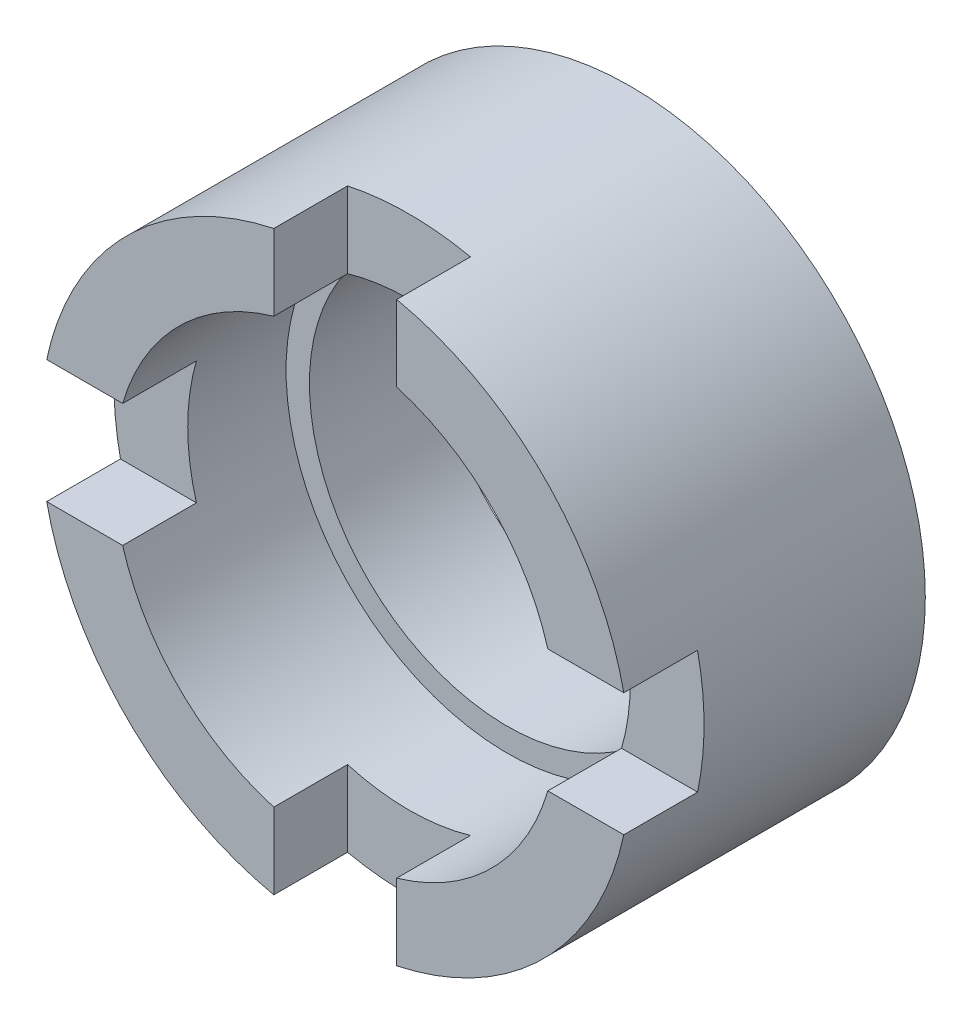
ISO-10303-21;
HEADER;
FILE_DESCRIPTION(('STEP AP214'),'2;1');
FILE_NAME('part.step','',(''),(''),'','','');
FILE_SCHEMA(('AUTOMOTIVE_DESIGN { 1 0 10303 214 1 1 1 1 }'));
ENDSEC;
DATA;
#1=APPLICATION_CONTEXT('core data for automotive mechanical design processes');
#2=APPLICATION_PROTOCOL_DEFINITION('international standard','automotive_design',2000,#1);
#3=PRODUCT_CONTEXT('',#1,'mechanical');
#4=PRODUCT('Part','Part','',(#3));
#5=PRODUCT_RELATED_PRODUCT_CATEGORY('part','',(#4));
#6=PRODUCT_DEFINITION_FORMATION('','',#4);
#7=PRODUCT_DEFINITION_CONTEXT('part definition',#1,'design');
#8=PRODUCT_DEFINITION('design','',#6,#7);
#9=PRODUCT_DEFINITION_SHAPE('','',#8);
#10=(LENGTH_UNIT() NAMED_UNIT(*) SI_UNIT(.MILLI.,.METRE.));
#11=(NAMED_UNIT(*) PLANE_ANGLE_UNIT() SI_UNIT($,.RADIAN.));
#12=(NAMED_UNIT(*) SI_UNIT($,.STERADIAN.) SOLID_ANGLE_UNIT());
#13=UNCERTAINTY_MEASURE_WITH_UNIT(LENGTH_MEASURE(1.E-05),#10,'distance_accuracy_value','');
#14=(GEOMETRIC_REPRESENTATION_CONTEXT(3) GLOBAL_UNCERTAINTY_ASSIGNED_CONTEXT((#13)) GLOBAL_UNIT_ASSIGNED_CONTEXT((#10,
#11,#12)) REPRESENTATION_CONTEXT('',''));
#15=CARTESIAN_POINT('',(0.,0.,0.));
#16=DIRECTION('',(0.,0.,1.));
#17=DIRECTION('',(1.,0.,0.));
#18=AXIS2_PLACEMENT_3D('',#15,#16,#17);
#19=CARTESIAN_POINT('',(0.,0.,12.));
#20=DIRECTION('',(0.,0.,-1.));
#21=DIRECTION('',(-1.,0.,0.));
#22=AXIS2_PLACEMENT_3D('',#19,#20,#21);
#23=CYLINDRICAL_SURFACE('',#22,8.05);
#24=CARTESIAN_POINT('',(0.,0.,0.));
#25=DIRECTION('',(0.,0.,1.));
#26=DIRECTION('',(1.,0.,0.));
#27=AXIS2_PLACEMENT_3D('',#24,#25,#26);
#28=CIRCLE('',#27,8.05);
#29=CARTESIAN_POINT('',(8.05,0.,0.));
#30=VERTEX_POINT('',#29);
#31=EDGE_CURVE('E224',#30,#30,#28,.T.);
#32=ORIENTED_EDGE('',*,*,#31,.F.);
#33=EDGE_LOOP('',(#32));
#34=FACE_BOUND('',#33,.T.);
#35=CARTESIAN_POINT('',(0.,0.,5.));
#36=DIRECTION('',(0.,0.,1.));
#37=DIRECTION('',(1.,0.,0.));
#38=AXIS2_PLACEMENT_3D('',#35,#36,#37);
#39=CIRCLE('',#38,8.05);
#40=CARTESIAN_POINT('',(8.05,0.,5.));
#41=VERTEX_POINT('',#40);
#42=EDGE_CURVE('E49',#41,#41,#39,.T.);
#43=ORIENTED_EDGE('',*,*,#42,.T.);
#44=EDGE_LOOP('',(#43));
#45=FACE_BOUND('',#44,.T.);
#46=ADVANCED_FACE('F45',(#34,#45),#23,.F.);
#47=CARTESIAN_POINT('',(0.,0.,12.));
#48=DIRECTION('',(0.,0.,1.));
#49=DIRECTION('',(1.,0.,0.));
#50=AXIS2_PLACEMENT_3D('',#47,#48,#49);
#51=PLANE('',#50);
#52=CARTESIAN_POINT('',(0.,0.,12.));
#53=DIRECTION('',(0.,0.,1.));
#54=DIRECTION('',(1.,0.,0.));
#55=AXIS2_PLACEMENT_3D('',#52,#53,#54);
#56=CIRCLE('',#55,9.);
#57=CARTESIAN_POINT('',(-2.5,8.64580823289529,12.));
#58=VERTEX_POINT('',#57);
#59=CARTESIAN_POINT('',(-8.64580823289529,2.5,12.));
#60=VERTEX_POINT('',#59);
#61=EDGE_CURVE('E178',#58,#60,#56,.T.);
#62=ORIENTED_EDGE('',*,*,#61,.F.);
#63=DIRECTION('',(0.,-1.,0.));
#64=VECTOR('',#63,1.);
#65=CARTESIAN_POINT('',(-2.5,16.5,12.));
#66=LINE('',#65,#64);
#67=CARTESIAN_POINT('',(-2.5,11.7366945943055,12.));
#68=VERTEX_POINT('',#67);
#69=EDGE_CURVE('E186',#68,#58,#66,.T.);
#70=ORIENTED_EDGE('',*,*,#69,.F.);
#71=CARTESIAN_POINT('',(0.,0.,12.));
#72=DIRECTION('',(0.,0.,1.));
#73=DIRECTION('',(1.,0.,0.));
#74=AXIS2_PLACEMENT_3D('',#71,#72,#73);
#75=CIRCLE('',#74,12.);
#76=CARTESIAN_POINT('',(-11.7366945943055,2.5,12.));
#77=VERTEX_POINT('',#76);
#78=EDGE_CURVE('E229',#68,#77,#75,.T.);
#79=ORIENTED_EDGE('',*,*,#78,.T.);
#80=DIRECTION('',(-1.,0.,0.));
#81=VECTOR('',#80,1.);
#82=CARTESIAN_POINT('',(-16.5,2.5,12.));
#83=LINE('',#82,#81);
#84=EDGE_CURVE('E194',#60,#77,#83,.T.);
#85=ORIENTED_EDGE('',*,*,#84,.F.);
#86=EDGE_LOOP('',(#62,#70,#79,#85));
#87=FACE_BOUND('',#86,.T.);
#88=ADVANCED_FACE('F251',(#87),#51,.T.);
#89=CARTESIAN_POINT('',(8.64580823289529,2.5,12.));
#90=VERTEX_POINT('',#89);
#91=CARTESIAN_POINT('',(2.5,8.64580823289529,12.));
#92=VERTEX_POINT('',#91);
#93=EDGE_CURVE('E160',#90,#92,#56,.T.);
#94=ORIENTED_EDGE('',*,*,#93,.F.);
#95=DIRECTION('',(-1.,0.,0.));
#96=VECTOR('',#95,1.);
#97=CARTESIAN_POINT('',(2.5,2.5,12.));
#98=LINE('',#97,#96);
#99=CARTESIAN_POINT('',(11.7366945943055,2.5,12.));
#100=VERTEX_POINT('',#99);
#101=EDGE_CURVE('E174',#100,#90,#98,.T.);
#102=ORIENTED_EDGE('',*,*,#101,.F.);
#103=CARTESIAN_POINT('',(2.5,11.7366945943055,12.));
#104=VERTEX_POINT('',#103);
#105=EDGE_CURVE('E54',#100,#104,#75,.T.);
#106=ORIENTED_EDGE('',*,*,#105,.T.);
#107=DIRECTION('',(0.,1.,0.));
#108=VECTOR('',#107,1.);
#109=CARTESIAN_POINT('',(2.5,16.5,12.));
#110=LINE('',#109,#108);
#111=EDGE_CURVE('E176',#92,#104,#110,.T.);
#112=ORIENTED_EDGE('',*,*,#111,.F.);
#113=EDGE_LOOP('',(#94,#102,#106,#112));
#114=FACE_BOUND('',#113,.T.);
#115=ADVANCED_FACE('F172',(#114),#51,.T.);
#116=CARTESIAN_POINT('',(2.5,-8.64580823289529,12.));
#117=VERTEX_POINT('',#116);
#118=CARTESIAN_POINT('',(8.64580823289529,-2.5,12.));
#119=VERTEX_POINT('',#118);
#120=EDGE_CURVE('E180',#117,#119,#56,.T.);
#121=ORIENTED_EDGE('',*,*,#120,.F.);
#122=DIRECTION('',(0.,1.,0.));
#123=VECTOR('',#122,1.);
#124=CARTESIAN_POINT('',(2.5,-2.5,12.));
#125=LINE('',#124,#123);
#126=CARTESIAN_POINT('',(2.50000000000001,-11.7366945943055,12.));
#127=VERTEX_POINT('',#126);
#128=EDGE_CURVE('E188',#127,#117,#125,.T.);
#129=ORIENTED_EDGE('',*,*,#128,.F.);
#130=CARTESIAN_POINT('',(11.7366945943055,-2.5,12.));
#131=VERTEX_POINT('',#130);
#132=EDGE_CURVE('E230',#127,#131,#75,.T.);
#133=ORIENTED_EDGE('',*,*,#132,.T.);
#134=DIRECTION('',(1.,0.,0.));
#135=VECTOR('',#134,1.);
#136=CARTESIAN_POINT('',(2.5,-2.5,12.));
#137=LINE('',#136,#135);
#138=EDGE_CURVE('E184',#119,#131,#137,.T.);
#139=ORIENTED_EDGE('',*,*,#138,.F.);
#140=EDGE_LOOP('',(#121,#129,#133,#139));
#141=FACE_BOUND('',#140,.T.);
#142=ADVANCED_FACE('F308',(#141),#51,.T.);
#143=CARTESIAN_POINT('',(-8.64580823289529,-2.5,12.));
#144=VERTEX_POINT('',#143);
#145=CARTESIAN_POINT('',(-2.5,-8.64580823289529,12.));
#146=VERTEX_POINT('',#145);
#147=EDGE_CURVE('E388',#144,#146,#56,.T.);
#148=ORIENTED_EDGE('',*,*,#147,.F.);
#149=DIRECTION('',(1.,0.,0.));
#150=VECTOR('',#149,1.);
#151=CARTESIAN_POINT('',(-16.5,-2.5,12.));
#152=LINE('',#151,#150);
#153=CARTESIAN_POINT('',(-11.7366945943055,-2.5,12.));
#154=VERTEX_POINT('',#153);
#155=EDGE_CURVE('E299',#154,#144,#152,.T.);
#156=ORIENTED_EDGE('',*,*,#155,.F.);
#157=CARTESIAN_POINT('',(-2.5,-11.7366945943055,12.));
#158=VERTEX_POINT('',#157);
#159=EDGE_CURVE('E235',#154,#158,#75,.T.);
#160=ORIENTED_EDGE('',*,*,#159,.T.);
#161=DIRECTION('',(0.,-1.,0.));
#162=VECTOR('',#161,1.);
#163=CARTESIAN_POINT('',(-2.5,-2.5,12.));
#164=LINE('',#163,#162);
#165=EDGE_CURVE('E302',#146,#158,#164,.T.);
#166=ORIENTED_EDGE('',*,*,#165,.F.);
#167=EDGE_LOOP('',(#148,#156,#160,#166));
#168=FACE_BOUND('',#167,.T.);
#169=ADVANCED_FACE('F347',(#168),#51,.T.);
#170=CARTESIAN_POINT('',(0.,0.,0.));
#171=DIRECTION('',(0.,0.,1.));
#172=DIRECTION('',(1.,0.,0.));
#173=AXIS2_PLACEMENT_3D('',#170,#171,#172);
#174=PLANE('',#173);
#175=CARTESIAN_POINT('',(0.,0.,0.));
#176=DIRECTION('',(0.,0.,1.));
#177=DIRECTION('',(1.,0.,0.));
#178=AXIS2_PLACEMENT_3D('',#175,#176,#177);
#179=CIRCLE('',#178,12.);
#180=CARTESIAN_POINT('',(12.,0.,0.));
#181=VERTEX_POINT('',#180);
#182=EDGE_CURVE('E227',#181,#181,#179,.T.);
#183=ORIENTED_EDGE('',*,*,#182,.F.);
#184=EDGE_LOOP('',(#183));
#185=FACE_BOUND('',#184,.T.);
#186=ORIENTED_EDGE('',*,*,#31,.T.);
#187=EDGE_LOOP('',(#186));
#188=FACE_BOUND('',#187,.T.);
#189=ADVANCED_FACE('F354',(#185,#188),#174,.F.);
#190=CARTESIAN_POINT('',(0.,0.,12.));
#191=DIRECTION('',(0.,0.,-1.));
#192=DIRECTION('',(-1.,0.,0.));
#193=AXIS2_PLACEMENT_3D('',#190,#191,#192);
#194=CYLINDRICAL_SURFACE('',#193,12.);
#195=ORIENTED_EDGE('',*,*,#78,.F.);
#196=DIRECTION('',(0.,0.,-1.));
#197=VECTOR('',#196,1.);
#198=CARTESIAN_POINT('',(-2.5,11.7366945943055,12.));
#199=LINE('',#198,#197);
#200=CARTESIAN_POINT('',(-2.5,11.7366945943055,9.));
#201=VERTEX_POINT('',#200);
#202=EDGE_CURVE('E218',#68,#201,#199,.T.);
#203=ORIENTED_EDGE('',*,*,#202,.T.);
#204=CARTESIAN_POINT('',(0.,0.,9.));
#205=DIRECTION('',(0.,0.,1.));
#206=DIRECTION('',(1.,0.,0.));
#207=AXIS2_PLACEMENT_3D('',#204,#205,#206);
#208=CIRCLE('',#207,12.);
#209=CARTESIAN_POINT('',(2.5,11.7366945943055,9.));
#210=VERTEX_POINT('',#209);
#211=EDGE_CURVE('E201',#210,#201,#208,.T.);
#212=ORIENTED_EDGE('',*,*,#211,.F.);
#213=DIRECTION('',(0.,0.,-1.));
#214=VECTOR('',#213,1.);
#215=CARTESIAN_POINT('',(2.5,11.7366945943055,12.));
#216=LINE('',#215,#214);
#217=EDGE_CURVE('E215',#210,#104,#216,.F.);
#218=ORIENTED_EDGE('',*,*,#217,.T.);
#219=ORIENTED_EDGE('',*,*,#105,.F.);
#220=DIRECTION('',(0.,0.,-1.));
#221=VECTOR('',#220,1.);
#222=CARTESIAN_POINT('',(11.7366945943055,2.5,12.));
#223=LINE('',#222,#221);
#224=CARTESIAN_POINT('',(11.7366945943055,2.5,9.));
#225=VERTEX_POINT('',#224);
#226=EDGE_CURVE('E183',#100,#225,#223,.T.);
#227=ORIENTED_EDGE('',*,*,#226,.T.);
#228=CARTESIAN_POINT('',(11.7366945943055,-2.5,9.));
#229=VERTEX_POINT('',#228);
#230=EDGE_CURVE('E197',#229,#225,#208,.T.);
#231=ORIENTED_EDGE('',*,*,#230,.F.);
#232=DIRECTION('',(0.,0.,-1.));
#233=VECTOR('',#232,1.);
#234=CARTESIAN_POINT('',(11.7366945943055,-2.5,12.));
#235=LINE('',#234,#233);
#236=EDGE_CURVE('E211',#229,#131,#235,.F.);
#237=ORIENTED_EDGE('',*,*,#236,.T.);
#238=ORIENTED_EDGE('',*,*,#132,.F.);
#239=DIRECTION('',(0.,0.,-1.));
#240=VECTOR('',#239,1.);
#241=CARTESIAN_POINT('',(2.50000000000001,-11.7366945943055,12.));
#242=LINE('',#241,#240);
#243=CARTESIAN_POINT('',(2.50000000000001,-11.7366945943055,9.));
#244=VERTEX_POINT('',#243);
#245=EDGE_CURVE('E208',#127,#244,#242,.T.);
#246=ORIENTED_EDGE('',*,*,#245,.T.);
#247=CARTESIAN_POINT('',(-2.5,-11.7366945943055,9.));
#248=VERTEX_POINT('',#247);
#249=EDGE_CURVE('E199',#248,#244,#208,.T.);
#250=ORIENTED_EDGE('',*,*,#249,.F.);
#251=DIRECTION('',(0.,0.,-1.));
#252=VECTOR('',#251,1.);
#253=CARTESIAN_POINT('',(-2.5,-11.7366945943055,12.));
#254=LINE('',#253,#252);
#255=EDGE_CURVE('E205',#248,#158,#254,.F.);
#256=ORIENTED_EDGE('',*,*,#255,.T.);
#257=ORIENTED_EDGE('',*,*,#159,.F.);
#258=DIRECTION('',(0.,0.,-1.));
#259=VECTOR('',#258,1.);
#260=CARTESIAN_POINT('',(-11.7366945943055,-2.5,12.));
#261=LINE('',#260,#259);
#262=CARTESIAN_POINT('',(-11.7366945943055,-2.5,9.));
#263=VERTEX_POINT('',#262);
#264=EDGE_CURVE('E202',#154,#263,#261,.T.);
#265=ORIENTED_EDGE('',*,*,#264,.T.);
#266=CARTESIAN_POINT('',(-11.7366945943055,2.5,9.));
#267=VERTEX_POINT('',#266);
#268=EDGE_CURVE('E68',#267,#263,#208,.T.);
#269=ORIENTED_EDGE('',*,*,#268,.F.);
#270=DIRECTION('',(0.,0.,-1.));
#271=VECTOR('',#270,1.);
#272=CARTESIAN_POINT('',(-11.7366945943055,2.5,12.));
#273=LINE('',#272,#271);
#274=EDGE_CURVE('E221',#267,#77,#273,.F.);
#275=ORIENTED_EDGE('',*,*,#274,.T.);
#276=EDGE_LOOP('',(#195,#203,#212,#218,#219,#227,#231,#237,#238,#246,#250,#256,#257,#265,#269,#275));
#277=FACE_BOUND('',#276,.T.);
#278=ORIENTED_EDGE('',*,*,#182,.T.);
#279=EDGE_LOOP('',(#278));
#280=FACE_BOUND('',#279,.T.);
#281=ADVANCED_FACE('F47',(#277,#280),#194,.T.);
#282=CARTESIAN_POINT('',(0.,0.,9.));
#283=DIRECTION('',(0.,0.,1.));
#284=DIRECTION('',(1.,0.,0.));
#285=AXIS2_PLACEMENT_3D('',#282,#283,#284);
#286=PLANE('',#285);
#287=CARTESIAN_POINT('',(0.,0.,9.));
#288=DIRECTION('',(0.,0.,1.));
#289=DIRECTION('',(1.,0.,0.));
#290=AXIS2_PLACEMENT_3D('',#287,#288,#289);
#291=CIRCLE('',#290,9.);
#292=CARTESIAN_POINT('',(8.64580823289529,-2.5,9.));
#293=VERTEX_POINT('',#292);
#294=CARTESIAN_POINT('',(8.64580823289529,2.5,9.));
#295=VERTEX_POINT('',#294);
#296=EDGE_CURVE('E162',#293,#295,#291,.T.);
#297=ORIENTED_EDGE('',*,*,#296,.F.);
#298=DIRECTION('',(1.,0.,0.));
#299=VECTOR('',#298,1.);
#300=CARTESIAN_POINT('',(2.5,-2.5,9.));
#301=LINE('',#300,#299);
#302=EDGE_CURVE('E289',#293,#229,#301,.T.);
#303=ORIENTED_EDGE('',*,*,#302,.T.);
#304=ORIENTED_EDGE('',*,*,#230,.T.);
#305=DIRECTION('',(-1.,0.,0.));
#306=VECTOR('',#305,1.);
#307=CARTESIAN_POINT('',(2.5,2.5,9.));
#308=LINE('',#307,#306);
#309=EDGE_CURVE('E291',#225,#295,#308,.T.);
#310=ORIENTED_EDGE('',*,*,#309,.T.);
#311=EDGE_LOOP('',(#297,#303,#304,#310));
#312=FACE_BOUND('',#311,.T.);
#313=ADVANCED_FACE('F316',(#312),#286,.T.);
#314=CARTESIAN_POINT('',(2.5,-2.5,9.));
#315=DIRECTION('',(0.,-1.,0.));
#316=DIRECTION('',(0.,0.,-1.));
#317=AXIS2_PLACEMENT_3D('',#314,#315,#316);
#318=PLANE('',#317);
#319=ORIENTED_EDGE('',*,*,#302,.F.);
#320=DIRECTION('',(0.,0.,1.));
#321=VECTOR('',#320,1.);
#322=CARTESIAN_POINT('',(8.64580823289529,-2.5,5.));
#323=LINE('',#322,#321);
#324=EDGE_CURVE('E280',#293,#119,#323,.T.);
#325=ORIENTED_EDGE('',*,*,#324,.T.);
#326=ORIENTED_EDGE('',*,*,#138,.T.);
#327=ORIENTED_EDGE('',*,*,#236,.F.);
#328=EDGE_LOOP('',(#319,#325,#326,#327));
#329=FACE_BOUND('',#328,.T.);
#330=ADVANCED_FACE('F314',(#329),#318,.F.);
#331=CARTESIAN_POINT('',(2.5,2.5,9.));
#332=DIRECTION('',(0.,1.,0.));
#333=DIRECTION('',(-1.,0.,0.));
#334=AXIS2_PLACEMENT_3D('',#331,#332,#333);
#335=PLANE('',#334);
#336=ORIENTED_EDGE('',*,*,#101,.T.);
#337=DIRECTION('',(0.,0.,1.));
#338=VECTOR('',#337,1.);
#339=CARTESIAN_POINT('',(8.64580823289529,2.5,5.));
#340=LINE('',#339,#338);
#341=EDGE_CURVE('E157',#90,#295,#340,.F.);
#342=ORIENTED_EDGE('',*,*,#341,.T.);
#343=ORIENTED_EDGE('',*,*,#309,.F.);
#344=ORIENTED_EDGE('',*,*,#226,.F.);
#345=EDGE_LOOP('',(#336,#342,#343,#344));
#346=FACE_BOUND('',#345,.T.);
#347=ADVANCED_FACE('F181',(#346),#335,.F.);
#348=CARTESIAN_POINT('',(0.,0.,9.));
#349=DIRECTION('',(0.,0.,1.));
#350=DIRECTION('',(1.,0.,0.));
#351=AXIS2_PLACEMENT_3D('',#348,#349,#350);
#352=CIRCLE('',#351,9.);
#353=CARTESIAN_POINT('',(-2.5,-8.64580823289529,9.));
#354=VERTEX_POINT('',#353);
#355=CARTESIAN_POINT('',(2.5,-8.64580823289529,9.));
#356=VERTEX_POINT('',#355);
#357=EDGE_CURVE('E275',#354,#356,#352,.T.);
#358=ORIENTED_EDGE('',*,*,#357,.F.);
#359=DIRECTION('',(0.,-1.,0.));
#360=VECTOR('',#359,1.);
#361=CARTESIAN_POINT('',(-2.5,-2.5,9.));
#362=LINE('',#361,#360);
#363=EDGE_CURVE('E284',#354,#248,#362,.T.);
#364=ORIENTED_EDGE('',*,*,#363,.T.);
#365=ORIENTED_EDGE('',*,*,#249,.T.);
#366=DIRECTION('',(0.,1.,0.));
#367=VECTOR('',#366,1.);
#368=CARTESIAN_POINT('',(2.5,-2.5,9.));
#369=LINE('',#368,#367);
#370=EDGE_CURVE('E286',#244,#356,#369,.T.);
#371=ORIENTED_EDGE('',*,*,#370,.T.);
#372=EDGE_LOOP('',(#358,#364,#365,#371));
#373=FACE_BOUND('',#372,.T.);
#374=ADVANCED_FACE('F364',(#373),#286,.T.);
#375=CARTESIAN_POINT('',(-2.5,-2.5,9.));
#376=DIRECTION('',(-1.,0.,0.));
#377=DIRECTION('',(0.,-1.,0.));
#378=AXIS2_PLACEMENT_3D('',#375,#376,#377);
#379=PLANE('',#378);
#380=ORIENTED_EDGE('',*,*,#363,.F.);
#381=DIRECTION('',(0.,0.,1.));
#382=VECTOR('',#381,1.);
#383=CARTESIAN_POINT('',(-2.5,-8.64580823289529,5.));
#384=LINE('',#383,#382);
#385=EDGE_CURVE('E167',#354,#146,#384,.T.);
#386=ORIENTED_EDGE('',*,*,#385,.T.);
#387=ORIENTED_EDGE('',*,*,#165,.T.);
#388=ORIENTED_EDGE('',*,*,#255,.F.);
#389=EDGE_LOOP('',(#380,#386,#387,#388));
#390=FACE_BOUND('',#389,.T.);
#391=ADVANCED_FACE('F371',(#390),#379,.F.);
#392=CARTESIAN_POINT('',(2.5,-2.5,9.));
#393=DIRECTION('',(1.,0.,0.));
#394=DIRECTION('',(0.,1.,0.));
#395=AXIS2_PLACEMENT_3D('',#392,#393,#394);
#396=PLANE('',#395);
#397=ORIENTED_EDGE('',*,*,#128,.T.);
#398=DIRECTION('',(0.,0.,1.));
#399=VECTOR('',#398,1.);
#400=CARTESIAN_POINT('',(2.5,-8.64580823289529,5.));
#401=LINE('',#400,#399);
#402=EDGE_CURVE('E272',#117,#356,#401,.F.);
#403=ORIENTED_EDGE('',*,*,#402,.T.);
#404=ORIENTED_EDGE('',*,*,#370,.F.);
#405=ORIENTED_EDGE('',*,*,#245,.F.);
#406=EDGE_LOOP('',(#397,#403,#404,#405));
#407=FACE_BOUND('',#406,.T.);
#408=ADVANCED_FACE('F305',(#407),#396,.F.);
#409=CARTESIAN_POINT('',(0.,0.,9.));
#410=DIRECTION('',(0.,0.,1.));
#411=DIRECTION('',(1.,0.,0.));
#412=AXIS2_PLACEMENT_3D('',#409,#410,#411);
#413=CIRCLE('',#412,9.);
#414=CARTESIAN_POINT('',(-8.64580823289529,2.5,9.));
#415=VERTEX_POINT('',#414);
#416=CARTESIAN_POINT('',(-8.64580823289529,-2.5,9.));
#417=VERTEX_POINT('',#416);
#418=EDGE_CURVE('E261',#415,#417,#413,.T.);
#419=ORIENTED_EDGE('',*,*,#418,.F.);
#420=DIRECTION('',(-1.,0.,0.));
#421=VECTOR('',#420,1.);
#422=CARTESIAN_POINT('',(-16.5,2.5,9.));
#423=LINE('',#422,#421);
#424=EDGE_CURVE('E200',#415,#267,#423,.T.);
#425=ORIENTED_EDGE('',*,*,#424,.T.);
#426=ORIENTED_EDGE('',*,*,#268,.T.);
#427=DIRECTION('',(1.,0.,0.));
#428=VECTOR('',#427,1.);
#429=CARTESIAN_POINT('',(-16.5,-2.5,9.));
#430=LINE('',#429,#428);
#431=EDGE_CURVE('E196',#263,#417,#430,.T.);
#432=ORIENTED_EDGE('',*,*,#431,.T.);
#433=EDGE_LOOP('',(#419,#425,#426,#432));
#434=FACE_BOUND('',#433,.T.);
#435=ADVANCED_FACE('F338',(#434),#286,.T.);
#436=CARTESIAN_POINT('',(-16.5,-2.5,9.));
#437=DIRECTION('',(0.,-1.,0.));
#438=DIRECTION('',(1.,0.,0.));
#439=AXIS2_PLACEMENT_3D('',#436,#437,#438);
#440=PLANE('',#439);
#441=ORIENTED_EDGE('',*,*,#155,.T.);
#442=DIRECTION('',(0.,0.,1.));
#443=VECTOR('',#442,1.);
#444=CARTESIAN_POINT('',(-8.64580823289529,-2.5,5.));
#445=LINE('',#444,#443);
#446=EDGE_CURVE('E264',#144,#417,#445,.F.);
#447=ORIENTED_EDGE('',*,*,#446,.T.);
#448=ORIENTED_EDGE('',*,*,#431,.F.);
#449=ORIENTED_EDGE('',*,*,#264,.F.);
#450=EDGE_LOOP('',(#441,#447,#448,#449));
#451=FACE_BOUND('',#450,.T.);
#452=ADVANCED_FACE('F351',(#451),#440,.F.);
#453=CARTESIAN_POINT('',(-16.5,2.5,9.));
#454=DIRECTION('',(0.,1.,0.));
#455=DIRECTION('',(-1.,0.,0.));
#456=AXIS2_PLACEMENT_3D('',#453,#454,#455);
#457=PLANE('',#456);
#458=ORIENTED_EDGE('',*,*,#424,.F.);
#459=DIRECTION('',(0.,0.,1.));
#460=VECTOR('',#459,1.);
#461=CARTESIAN_POINT('',(-8.64580823289529,2.5,5.));
#462=LINE('',#461,#460);
#463=EDGE_CURVE('E259',#415,#60,#462,.T.);
#464=ORIENTED_EDGE('',*,*,#463,.T.);
#465=ORIENTED_EDGE('',*,*,#84,.T.);
#466=ORIENTED_EDGE('',*,*,#274,.F.);
#467=EDGE_LOOP('',(#458,#464,#465,#466));
#468=FACE_BOUND('',#467,.T.);
#469=ADVANCED_FACE('F257',(#468),#457,.F.);
#470=CARTESIAN_POINT('',(-2.5,16.5,9.));
#471=DIRECTION('',(-1.,0.,0.));
#472=DIRECTION('',(0.,-1.,0.));
#473=AXIS2_PLACEMENT_3D('',#470,#471,#472);
#474=PLANE('',#473);
#475=ORIENTED_EDGE('',*,*,#69,.T.);
#476=DIRECTION('',(0.,0.,1.));
#477=VECTOR('',#476,1.);
#478=CARTESIAN_POINT('',(-2.5,8.64580823289529,5.));
#479=LINE('',#478,#477);
#480=CARTESIAN_POINT('',(-2.5,8.64580823289529,9.));
#481=VERTEX_POINT('',#480);
#482=EDGE_CURVE('E262',#58,#481,#479,.F.);
#483=ORIENTED_EDGE('',*,*,#482,.T.);
#484=DIRECTION('',(0.,-1.,0.));
#485=VECTOR('',#484,1.);
#486=CARTESIAN_POINT('',(-2.5,16.5,9.));
#487=LINE('',#486,#485);
#488=EDGE_CURVE('E295',#201,#481,#487,.T.);
#489=ORIENTED_EDGE('',*,*,#488,.F.);
#490=ORIENTED_EDGE('',*,*,#202,.F.);
#491=EDGE_LOOP('',(#475,#483,#489,#490));
#492=FACE_BOUND('',#491,.T.);
#493=ADVANCED_FACE('F393',(#492),#474,.F.);
#494=CARTESIAN_POINT('',(2.5,16.5,9.));
#495=DIRECTION('',(1.,0.,0.));
#496=DIRECTION('',(0.,1.,0.));
#497=AXIS2_PLACEMENT_3D('',#494,#495,#496);
#498=PLANE('',#497);
#499=DIRECTION('',(0.,1.,0.));
#500=VECTOR('',#499,1.);
#501=CARTESIAN_POINT('',(2.5,16.5,9.));
#502=LINE('',#501,#500);
#503=CARTESIAN_POINT('',(2.5,8.64580823289529,9.));
#504=VERTEX_POINT('',#503);
#505=EDGE_CURVE('E293',#504,#210,#502,.T.);
#506=ORIENTED_EDGE('',*,*,#505,.F.);
#507=DIRECTION('',(0.,0.,1.));
#508=VECTOR('',#507,1.);
#509=CARTESIAN_POINT('',(2.5,8.64580823289529,5.));
#510=LINE('',#509,#508);
#511=EDGE_CURVE('E60',#504,#92,#510,.T.);
#512=ORIENTED_EDGE('',*,*,#511,.T.);
#513=ORIENTED_EDGE('',*,*,#111,.T.);
#514=ORIENTED_EDGE('',*,*,#217,.F.);
#515=EDGE_LOOP('',(#506,#512,#513,#514));
#516=FACE_BOUND('',#515,.T.);
#517=ADVANCED_FACE('F320',(#516),#498,.F.);
#518=CARTESIAN_POINT('',(0.,0.,9.));
#519=DIRECTION('',(0.,0.,1.));
#520=DIRECTION('',(1.,0.,0.));
#521=AXIS2_PLACEMENT_3D('',#518,#519,#520);
#522=CIRCLE('',#521,9.);
#523=EDGE_CURVE('E11',#504,#481,#522,.T.);
#524=ORIENTED_EDGE('',*,*,#523,.F.);
#525=ORIENTED_EDGE('',*,*,#505,.T.);
#526=ORIENTED_EDGE('',*,*,#211,.T.);
#527=ORIENTED_EDGE('',*,*,#488,.T.);
#528=EDGE_LOOP('',(#524,#525,#526,#527));
#529=FACE_BOUND('',#528,.T.);
#530=ADVANCED_FACE('F328',(#529),#286,.T.);
#531=CARTESIAN_POINT('',(0.,0.,5.));
#532=DIRECTION('',(0.,0.,1.));
#533=DIRECTION('',(1.,0.,0.));
#534=AXIS2_PLACEMENT_3D('',#531,#532,#533);
#535=CYLINDRICAL_SURFACE('',#534,9.);
#536=CARTESIAN_POINT('',(0.,0.,5.));
#537=DIRECTION('',(0.,0.,1.));
#538=DIRECTION('',(1.,0.,0.));
#539=AXIS2_PLACEMENT_3D('',#536,#537,#538);
#540=CIRCLE('',#539,9.);
#541=CARTESIAN_POINT('',(9.,0.,5.));
#542=VERTEX_POINT('',#541);
#543=EDGE_CURVE('E177',#542,#542,#540,.T.);
#544=ORIENTED_EDGE('',*,*,#543,.F.);
#545=EDGE_LOOP('',(#544));
#546=FACE_BOUND('',#545,.T.);
#547=ORIENTED_EDGE('',*,*,#296,.T.);
#548=ORIENTED_EDGE('',*,*,#341,.F.);
#549=ORIENTED_EDGE('',*,*,#93,.T.);
#550=ORIENTED_EDGE('',*,*,#511,.F.);
#551=ORIENTED_EDGE('',*,*,#523,.T.);
#552=ORIENTED_EDGE('',*,*,#482,.F.);
#553=ORIENTED_EDGE('',*,*,#61,.T.);
#554=ORIENTED_EDGE('',*,*,#463,.F.);
#555=ORIENTED_EDGE('',*,*,#418,.T.);
#556=ORIENTED_EDGE('',*,*,#446,.F.);
#557=ORIENTED_EDGE('',*,*,#147,.T.);
#558=ORIENTED_EDGE('',*,*,#385,.F.);
#559=ORIENTED_EDGE('',*,*,#357,.T.);
#560=ORIENTED_EDGE('',*,*,#402,.F.);
#561=ORIENTED_EDGE('',*,*,#120,.T.);
#562=ORIENTED_EDGE('',*,*,#324,.F.);
#563=EDGE_LOOP('',(#547,#548,#549,#550,#551,#552,#553,#554,#555,#556,#557,#558,#559,#560,#561,#562));
#564=FACE_BOUND('',#563,.T.);
#565=ADVANCED_FACE('F159',(#546,#564),#535,.F.);
#566=CARTESIAN_POINT('',(0.,0.,5.));
#567=DIRECTION('',(0.,0.,1.));
#568=DIRECTION('',(1.,0.,0.));
#569=AXIS2_PLACEMENT_3D('',#566,#567,#568);
#570=PLANE('',#569);
#571=ORIENTED_EDGE('',*,*,#42,.F.);
#572=EDGE_LOOP('',(#571));
#573=FACE_BOUND('',#572,.T.);
#574=ORIENTED_EDGE('',*,*,#543,.T.);
#575=EDGE_LOOP('',(#574));
#576=FACE_BOUND('',#575,.T.);
#577=ADVANCED_FACE('F325',(#573,#576),#570,.T.);
#578=CLOSED_SHELL('',(#46,#88,#115,#142,#169,#189,#281,#313,#330,#347,#374,#391,#408,#435,#452,
#469,#493,#517,#530,#565,#577));
#579=MANIFOLD_SOLID_BREP('B2',#578);
#580=ADVANCED_BREP_SHAPE_REPRESENTATION('',(#18,#579),#14);
#581=SHAPE_DEFINITION_REPRESENTATION(#9,#580);
ENDSEC;
END-ISO-10303-21;
